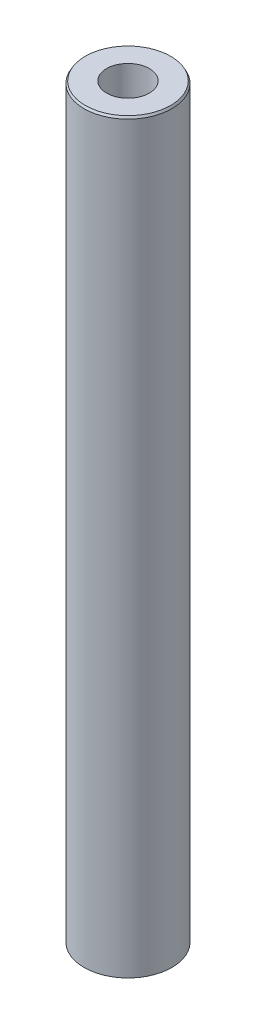
ISO-10303-21;
HEADER;
FILE_DESCRIPTION(('STEP AP214'),'2;1');
FILE_NAME('part.step','',(''),(''),'','','');
FILE_SCHEMA(('AUTOMOTIVE_DESIGN { 1 0 10303 214 1 1 1 1 }'));
ENDSEC;
DATA;
#1=APPLICATION_CONTEXT('core data for automotive mechanical design processes');
#2=APPLICATION_PROTOCOL_DEFINITION('international standard','automotive_design',2000,#1);
#3=PRODUCT_CONTEXT('',#1,'mechanical');
#4=PRODUCT('Part','Part','',(#3));
#5=PRODUCT_RELATED_PRODUCT_CATEGORY('part','',(#4));
#6=PRODUCT_DEFINITION_FORMATION('','',#4);
#7=PRODUCT_DEFINITION_CONTEXT('part definition',#1,'design');
#8=PRODUCT_DEFINITION('design','',#6,#7);
#9=PRODUCT_DEFINITION_SHAPE('','',#8);
#10=(LENGTH_UNIT() NAMED_UNIT(*) SI_UNIT(.MILLI.,.METRE.));
#11=(NAMED_UNIT(*) PLANE_ANGLE_UNIT() SI_UNIT($,.RADIAN.));
#12=(NAMED_UNIT(*) SI_UNIT($,.STERADIAN.) SOLID_ANGLE_UNIT());
#13=UNCERTAINTY_MEASURE_WITH_UNIT(LENGTH_MEASURE(1.E-05),#10,'distance_accuracy_value','');
#14=(GEOMETRIC_REPRESENTATION_CONTEXT(3) GLOBAL_UNCERTAINTY_ASSIGNED_CONTEXT((#13)) GLOBAL_UNIT_ASSIGNED_CONTEXT((#10,
#11,#12)) REPRESENTATION_CONTEXT('',''));
#15=CARTESIAN_POINT('',(0.,0.,0.));
#16=DIRECTION('',(0.,0.,1.));
#17=DIRECTION('',(1.,0.,0.));
#18=AXIS2_PLACEMENT_3D('',#15,#16,#17);
#19=CARTESIAN_POINT('',(0.,212.698721028615,0.));
#20=DIRECTION('',(0.,-1.,0.));
#21=DIRECTION('',(0.,0.,-1.));
#22=AXIS2_PLACEMENT_3D('',#19,#20,#21);
#23=CYLINDRICAL_SURFACE('',#22,12.5);
#24=CARTESIAN_POINT('',(0.,212.083854744496,0.));
#25=DIRECTION('',(0.,1.,0.));
#26=DIRECTION('',(0.,0.,1.));
#27=AXIS2_PLACEMENT_3D('',#24,#25,#26);
#28=CIRCLE('',#27,12.5);
#29=CARTESIAN_POINT('',(0.,212.083854744496,12.5));
#30=VERTEX_POINT('',#29);
#31=EDGE_CURVE('E50',#30,#30,#28,.F.);
#32=ORIENTED_EDGE('',*,*,#31,.T.);
#33=EDGE_LOOP('',(#32));
#34=FACE_BOUND('',#33,.T.);
#35=CARTESIAN_POINT('',(0.,0.354993214651961,0.));
#36=DIRECTION('',(0.,1.,0.));
#37=DIRECTION('',(0.,0.,1.));
#38=AXIS2_PLACEMENT_3D('',#35,#36,#37);
#39=CIRCLE('',#38,12.5);
#40=CARTESIAN_POINT('',(0.,0.354993214651961,12.5));
#41=VERTEX_POINT('',#40);
#42=EDGE_CURVE('E51',#41,#41,#39,.T.);
#43=ORIENTED_EDGE('',*,*,#42,.T.);
#44=EDGE_LOOP('',(#43));
#45=FACE_BOUND('',#44,.T.);
#46=ADVANCED_FACE('F39',(#34,#45),#23,.T.);
#47=CARTESIAN_POINT('',(0.,212.698721028615,0.));
#48=DIRECTION('',(0.,1.,0.));
#49=DIRECTION('',(0.,0.,1.));
#50=AXIS2_PLACEMENT_3D('',#47,#48,#49);
#51=PLANE('',#50);
#52=CARTESIAN_POINT('',(0.,212.698721028615,0.));
#53=DIRECTION('',(0.,1.,0.));
#54=DIRECTION('',(0.,0.,1.));
#55=AXIS2_PLACEMENT_3D('',#52,#53,#54);
#56=CIRCLE('',#55,12.145006785348);
#57=CARTESIAN_POINT('',(0.,212.698721028615,12.145006785348));
#58=VERTEX_POINT('',#57);
#59=EDGE_CURVE('E54',#58,#58,#56,.T.);
#60=ORIENTED_EDGE('',*,*,#59,.T.);
#61=EDGE_LOOP('',(#60));
#62=FACE_BOUND('',#61,.T.);
#63=CARTESIAN_POINT('',(0.,212.698721028615,0.));
#64=DIRECTION('',(0.,1.,0.));
#65=DIRECTION('',(0.,0.,1.));
#66=AXIS2_PLACEMENT_3D('',#63,#64,#65);
#67=CIRCLE('',#66,6.07297129725254);
#68=CARTESIAN_POINT('',(0.,212.698721028615,6.07297129725254));
#69=VERTEX_POINT('',#68);
#70=EDGE_CURVE('E58',#69,#69,#67,.T.);
#71=ORIENTED_EDGE('',*,*,#70,.F.);
#72=EDGE_LOOP('',(#71));
#73=FACE_BOUND('',#72,.T.);
#74=ADVANCED_FACE('F69',(#62,#73),#51,.T.);
#75=CARTESIAN_POINT('',(0.,0.,0.));
#76=DIRECTION('',(0.,1.,0.));
#77=DIRECTION('',(0.,0.,1.));
#78=AXIS2_PLACEMENT_3D('',#75,#76,#77);
#79=PLANE('',#78);
#80=CARTESIAN_POINT('',(0.,0.,0.));
#81=DIRECTION('',(0.,1.,0.));
#82=DIRECTION('',(0.,0.,1.));
#83=AXIS2_PLACEMENT_3D('',#80,#81,#82);
#84=CIRCLE('',#83,11.8851337158806);
#85=CARTESIAN_POINT('',(0.,0.,11.8851337158806));
#86=VERTEX_POINT('',#85);
#87=EDGE_CURVE('E10',#86,#86,#84,.F.);
#88=ORIENTED_EDGE('',*,*,#87,.T.);
#89=EDGE_LOOP('',(#88));
#90=FACE_BOUND('',#89,.T.);
#91=CARTESIAN_POINT('',(0.,0.,0.));
#92=DIRECTION('',(0.,1.,0.));
#93=DIRECTION('',(0.,0.,1.));
#94=AXIS2_PLACEMENT_3D('',#91,#92,#93);
#95=CIRCLE('',#94,6.07297129725254);
#96=CARTESIAN_POINT('',(0.,0.,6.07297129725254));
#97=VERTEX_POINT('',#96);
#98=EDGE_CURVE('E63',#97,#97,#95,.T.);
#99=ORIENTED_EDGE('',*,*,#98,.T.);
#100=EDGE_LOOP('',(#99));
#101=FACE_BOUND('',#100,.T.);
#102=ADVANCED_FACE('F75',(#90,#101),#79,.F.);
#103=CARTESIAN_POINT('',(0.,212.698721028615,0.));
#104=DIRECTION('',(0.,-1.,0.));
#105=DIRECTION('',(0.,0.,-1.));
#106=AXIS2_PLACEMENT_3D('',#103,#104,#105);
#107=CYLINDRICAL_SURFACE('',#106,6.07297129725254);
#108=ORIENTED_EDGE('',*,*,#70,.T.);
#109=EDGE_LOOP('',(#108));
#110=FACE_BOUND('',#109,.T.);
#111=ORIENTED_EDGE('',*,*,#98,.F.);
#112=EDGE_LOOP('',(#111));
#113=FACE_BOUND('',#112,.T.);
#114=ADVANCED_FACE('F70',(#110,#113),#107,.F.);
#115=CARTESIAN_POINT('',(0.,212.698721028615,0.));
#116=DIRECTION('',(0.,-1.,0.));
#117=DIRECTION('',(0.,0.,-1.));
#118=AXIS2_PLACEMENT_3D('',#115,#116,#117);
#119=CONICAL_SURFACE('',#118,12.145006785348,0.523598775598291);
#120=ORIENTED_EDGE('',*,*,#31,.F.);
#121=EDGE_LOOP('',(#120));
#122=FACE_BOUND('',#121,.T.);
#123=ORIENTED_EDGE('',*,*,#59,.F.);
#124=EDGE_LOOP('',(#123));
#125=FACE_BOUND('',#124,.T.);
#126=ADVANCED_FACE('F81',(#122,#125),#119,.T.);
#127=CARTESIAN_POINT('',(0.,0.354993214651961,0.));
#128=DIRECTION('',(0.,1.,0.));
#129=DIRECTION('',(0.,0.,1.));
#130=AXIS2_PLACEMENT_3D('',#127,#128,#129);
#131=CONICAL_SURFACE('',#130,12.5,1.0471975511966);
#132=ORIENTED_EDGE('',*,*,#87,.F.);
#133=EDGE_LOOP('',(#132));
#134=FACE_BOUND('',#133,.T.);
#135=ORIENTED_EDGE('',*,*,#42,.F.);
#136=EDGE_LOOP('',(#135));
#137=FACE_BOUND('',#136,.T.);
#138=ADVANCED_FACE('F45',(#134,#137),#131,.T.);
#139=CLOSED_SHELL('',(#46,#74,#102,#114,#126,#138));
#140=MANIFOLD_SOLID_BREP('B2',#139);
#141=ADVANCED_BREP_SHAPE_REPRESENTATION('',(#18,#140),#14);
#142=SHAPE_DEFINITION_REPRESENTATION(#9,#141);
ENDSEC;
END-ISO-10303-21;
